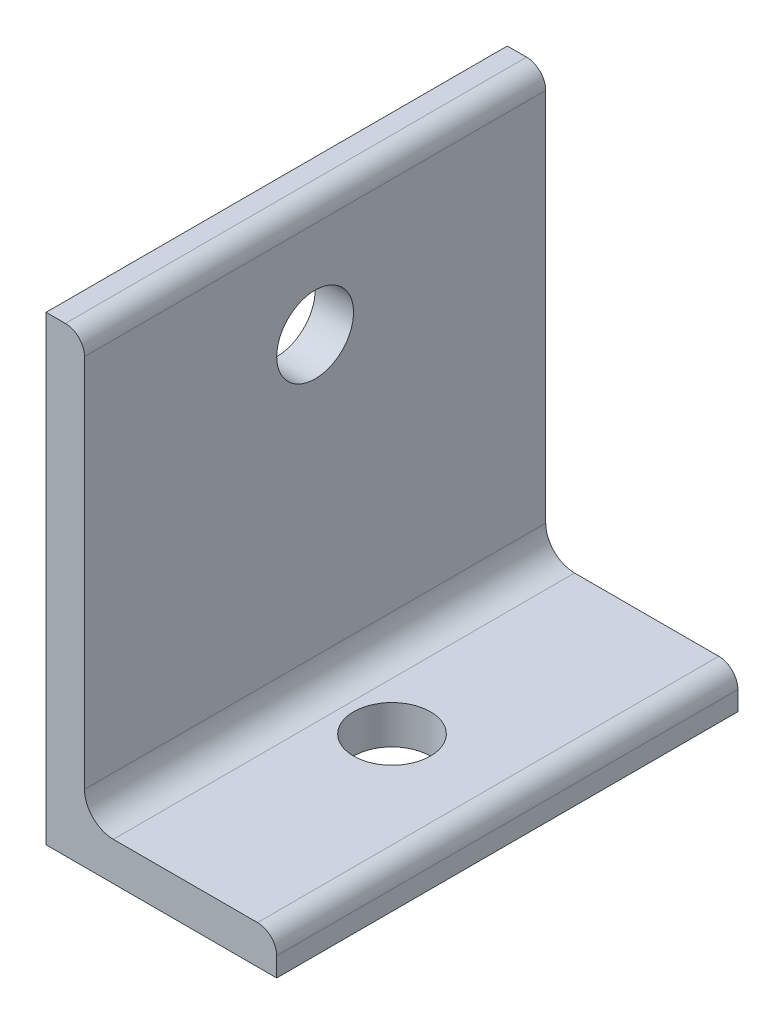
ISO-10303-21;
HEADER;
FILE_DESCRIPTION(('STEP AP214'),'2;1');
FILE_NAME('part.step','',(''),(''),'','','');
FILE_SCHEMA(('AUTOMOTIVE_DESIGN { 1 0 10303 214 1 1 1 1 }'));
ENDSEC;
DATA;
#1=APPLICATION_CONTEXT('core data for automotive mechanical design processes');
#2=APPLICATION_PROTOCOL_DEFINITION('international standard','automotive_design',2000,#1);
#3=PRODUCT_CONTEXT('',#1,'mechanical');
#4=PRODUCT('Part','Part','',(#3));
#5=PRODUCT_RELATED_PRODUCT_CATEGORY('part','',(#4));
#6=PRODUCT_DEFINITION_FORMATION('','',#4);
#7=PRODUCT_DEFINITION_CONTEXT('part definition',#1,'design');
#8=PRODUCT_DEFINITION('design','',#6,#7);
#9=PRODUCT_DEFINITION_SHAPE('','',#8);
#10=(LENGTH_UNIT() NAMED_UNIT(*) SI_UNIT(.MILLI.,.METRE.));
#11=(NAMED_UNIT(*) PLANE_ANGLE_UNIT() SI_UNIT($,.RADIAN.));
#12=(NAMED_UNIT(*) SI_UNIT($,.STERADIAN.) SOLID_ANGLE_UNIT());
#13=UNCERTAINTY_MEASURE_WITH_UNIT(LENGTH_MEASURE(1.E-05),#10,'distance_accuracy_value','');
#14=(GEOMETRIC_REPRESENTATION_CONTEXT(3) GLOBAL_UNCERTAINTY_ASSIGNED_CONTEXT((#13)) GLOBAL_UNIT_ASSIGNED_CONTEXT((#10,
#11,#12)) REPRESENTATION_CONTEXT('',''));
#15=CARTESIAN_POINT('',(0.,0.,0.));
#16=DIRECTION('',(0.,0.,1.));
#17=DIRECTION('',(1.,0.,0.));
#18=AXIS2_PLACEMENT_3D('',#15,#16,#17);
#19=CARTESIAN_POINT('',(38.1,0.,38.1));
#20=DIRECTION('',(0.,1.,0.));
#21=DIRECTION('',(-1.,0.,0.));
#22=AXIS2_PLACEMENT_3D('',#19,#20,#21);
#23=PLANE('',#22);
#24=CARTESIAN_POINT('',(19.05,0.,0.));
#25=DIRECTION('',(0.,-1.,0.));
#26=DIRECTION('',(1.,0.,0.));
#27=AXIS2_PLACEMENT_3D('',#24,#25,#26);
#28=CIRCLE('',#27,6.35);
#29=CARTESIAN_POINT('',(25.4,0.,0.));
#30=VERTEX_POINT('',#29);
#31=EDGE_CURVE('E196',#30,#30,#28,.T.);
#32=ORIENTED_EDGE('',*,*,#31,.F.);
#33=EDGE_LOOP('',(#32));
#34=FACE_BOUND('',#33,.T.);
#35=DIRECTION('',(1.,0.,0.));
#36=VECTOR('',#35,1.);
#37=CARTESIAN_POINT('',(38.1,0.,-38.1));
#38=LINE('',#37,#36);
#39=CARTESIAN_POINT('',(0.,0.,-38.1));
#40=VERTEX_POINT('',#39);
#41=CARTESIAN_POINT('',(38.1,0.,-38.1));
#42=VERTEX_POINT('',#41);
#43=EDGE_CURVE('E136',#40,#42,#38,.T.);
#44=ORIENTED_EDGE('',*,*,#43,.T.);
#45=DIRECTION('',(0.,0.,-1.));
#46=VECTOR('',#45,1.);
#47=CARTESIAN_POINT('',(38.1,0.,38.1));
#48=LINE('',#47,#46);
#49=CARTESIAN_POINT('',(38.1,0.,38.1));
#50=VERTEX_POINT('',#49);
#51=EDGE_CURVE('E11',#50,#42,#48,.T.);
#52=ORIENTED_EDGE('',*,*,#51,.F.);
#53=DIRECTION('',(1.,0.,0.));
#54=VECTOR('',#53,1.);
#55=CARTESIAN_POINT('',(38.1,0.,38.1));
#56=LINE('',#55,#54);
#57=CARTESIAN_POINT('',(0.,0.,38.1));
#58=VERTEX_POINT('',#57);
#59=EDGE_CURVE('E153',#58,#50,#56,.T.);
#60=ORIENTED_EDGE('',*,*,#59,.F.);
#61=DIRECTION('',(0.,0.,-1.));
#62=VECTOR('',#61,1.);
#63=CARTESIAN_POINT('',(0.,0.,38.1));
#64=LINE('',#63,#62);
#65=EDGE_CURVE('E132',#58,#40,#64,.T.);
#66=ORIENTED_EDGE('',*,*,#65,.T.);
#67=EDGE_LOOP('',(#44,#52,#60,#66));
#68=FACE_BOUND('',#67,.T.);
#69=ADVANCED_FACE('F34',(#34,#68),#23,.F.);
#70=CARTESIAN_POINT('',(38.1,3.18008,38.1));
#71=DIRECTION('',(-1.,0.,0.));
#72=DIRECTION('',(0.,0.,1.));
#73=AXIS2_PLACEMENT_3D('',#70,#71,#72);
#74=PLANE('',#73);
#75=DIRECTION('',(0.,1.,0.));
#76=VECTOR('',#75,1.);
#77=CARTESIAN_POINT('',(38.1,3.18008,-38.1));
#78=LINE('',#77,#76);
#79=CARTESIAN_POINT('',(38.1,3.18008,-38.1));
#80=VERTEX_POINT('',#79);
#81=EDGE_CURVE('E139',#42,#80,#78,.T.);
#82=ORIENTED_EDGE('',*,*,#81,.T.);
#83=DIRECTION('',(0.,0.,-1.));
#84=VECTOR('',#83,1.);
#85=CARTESIAN_POINT('',(38.1,3.18008,38.1));
#86=LINE('',#85,#84);
#87=CARTESIAN_POINT('',(38.1,3.18008,38.1));
#88=VERTEX_POINT('',#87);
#89=EDGE_CURVE('E42',#88,#80,#86,.T.);
#90=ORIENTED_EDGE('',*,*,#89,.F.);
#91=DIRECTION('',(0.,1.,0.));
#92=VECTOR('',#91,1.);
#93=CARTESIAN_POINT('',(38.1,3.18008,38.1));
#94=LINE('',#93,#92);
#95=EDGE_CURVE('E96',#50,#88,#94,.T.);
#96=ORIENTED_EDGE('',*,*,#95,.F.);
#97=ORIENTED_EDGE('',*,*,#51,.T.);
#98=EDGE_LOOP('',(#82,#90,#96,#97));
#99=FACE_BOUND('',#98,.T.);
#100=ADVANCED_FACE('F220',(#99),#74,.F.);
#101=CARTESIAN_POINT('',(34.93008,3.18008,38.1));
#102=DIRECTION('',(0.,0.,-1.));
#103=DIRECTION('',(-1.,0.,0.));
#104=AXIS2_PLACEMENT_3D('',#101,#102,#103);
#105=CYLINDRICAL_SURFACE('',#104,3.16992);
#106=CARTESIAN_POINT('',(34.93008,3.18008,-38.1));
#107=DIRECTION('',(0.,0.,1.));
#108=DIRECTION('',(1.,0.,0.));
#109=AXIS2_PLACEMENT_3D('',#106,#107,#108);
#110=CIRCLE('',#109,3.16992);
#111=CARTESIAN_POINT('',(34.93008,6.35,-38.1));
#112=VERTEX_POINT('',#111);
#113=EDGE_CURVE('E142',#80,#112,#110,.T.);
#114=ORIENTED_EDGE('',*,*,#113,.T.);
#115=DIRECTION('',(0.,0.,-1.));
#116=VECTOR('',#115,1.);
#117=CARTESIAN_POINT('',(34.93008,6.35,38.1));
#118=LINE('',#117,#116);
#119=CARTESIAN_POINT('',(34.93008,6.35,38.1));
#120=VERTEX_POINT('',#119);
#121=EDGE_CURVE('E163',#120,#112,#118,.T.);
#122=ORIENTED_EDGE('',*,*,#121,.F.);
#123=CARTESIAN_POINT('',(34.93008,3.18008,38.1));
#124=DIRECTION('',(0.,0.,1.));
#125=DIRECTION('',(1.,0.,0.));
#126=AXIS2_PLACEMENT_3D('',#123,#124,#125);
#127=CIRCLE('',#126,3.16992);
#128=EDGE_CURVE('E171',#88,#120,#127,.T.);
#129=ORIENTED_EDGE('',*,*,#128,.F.);
#130=ORIENTED_EDGE('',*,*,#89,.T.);
#131=EDGE_LOOP('',(#114,#122,#129,#130));
#132=FACE_BOUND('',#131,.T.);
#133=ADVANCED_FACE('F169',(#132),#105,.T.);
#134=CARTESIAN_POINT('',(11.1125,6.35,38.1));
#135=DIRECTION('',(0.,-1.,0.));
#136=DIRECTION('',(1.,0.,0.));
#137=AXIS2_PLACEMENT_3D('',#134,#135,#136);
#138=PLANE('',#137);
#139=CARTESIAN_POINT('',(19.05,6.35000000000001,0.));
#140=DIRECTION('',(0.,-1.,0.));
#141=DIRECTION('',(1.,0.,0.));
#142=AXIS2_PLACEMENT_3D('',#139,#140,#141);
#143=CIRCLE('',#142,6.35);
#144=CARTESIAN_POINT('',(25.4,6.35000000000001,0.));
#145=VERTEX_POINT('',#144);
#146=EDGE_CURVE('E140',#145,#145,#143,.F.);
#147=ORIENTED_EDGE('',*,*,#146,.F.);
#148=EDGE_LOOP('',(#147));
#149=FACE_BOUND('',#148,.T.);
#150=DIRECTION('',(-1.,0.,0.));
#151=VECTOR('',#150,1.);
#152=CARTESIAN_POINT('',(11.1125,6.35,-38.1));
#153=LINE('',#152,#151);
#154=CARTESIAN_POINT('',(11.1125,6.35,-38.1));
#155=VERTEX_POINT('',#154);
#156=EDGE_CURVE('E144',#112,#155,#153,.T.);
#157=ORIENTED_EDGE('',*,*,#156,.T.);
#158=DIRECTION('',(0.,0.,-1.));
#159=VECTOR('',#158,1.);
#160=CARTESIAN_POINT('',(11.1125,6.35,38.1));
#161=LINE('',#160,#159);
#162=CARTESIAN_POINT('',(11.1125,6.35,38.1));
#163=VERTEX_POINT('',#162);
#164=EDGE_CURVE('E160',#163,#155,#161,.T.);
#165=ORIENTED_EDGE('',*,*,#164,.F.);
#166=DIRECTION('',(-1.,0.,0.));
#167=VECTOR('',#166,1.);
#168=CARTESIAN_POINT('',(11.1125,6.35,38.1));
#169=LINE('',#168,#167);
#170=EDGE_CURVE('E187',#120,#163,#169,.T.);
#171=ORIENTED_EDGE('',*,*,#170,.F.);
#172=ORIENTED_EDGE('',*,*,#121,.T.);
#173=EDGE_LOOP('',(#157,#165,#171,#172));
#174=FACE_BOUND('',#173,.T.);
#175=ADVANCED_FACE('F180',(#149,#174),#138,.F.);
#176=CARTESIAN_POINT('',(11.1125,11.1125,38.1));
#177=DIRECTION('',(0.,0.,-1.));
#178=DIRECTION('',(-1.,0.,0.));
#179=AXIS2_PLACEMENT_3D('',#176,#177,#178);
#180=CYLINDRICAL_SURFACE('',#179,4.7625);
#181=CARTESIAN_POINT('',(11.1125,11.1125,-38.1));
#182=DIRECTION('',(0.,0.,-1.));
#183=DIRECTION('',(-1.,0.,0.));
#184=AXIS2_PLACEMENT_3D('',#181,#182,#183);
#185=CIRCLE('',#184,4.7625);
#186=CARTESIAN_POINT('',(6.35000000000001,11.1125,-38.1));
#187=VERTEX_POINT('',#186);
#188=EDGE_CURVE('E146',#155,#187,#185,.T.);
#189=ORIENTED_EDGE('',*,*,#188,.T.);
#190=DIRECTION('',(0.,0.,-1.));
#191=VECTOR('',#190,1.);
#192=CARTESIAN_POINT('',(6.35000000000001,11.1125,38.1));
#193=LINE('',#192,#191);
#194=CARTESIAN_POINT('',(6.35000000000001,11.1125,38.1));
#195=VERTEX_POINT('',#194);
#196=EDGE_CURVE('E157',#195,#187,#193,.T.);
#197=ORIENTED_EDGE('',*,*,#196,.F.);
#198=CARTESIAN_POINT('',(11.1125,11.1125,38.1));
#199=DIRECTION('',(0.,0.,-1.));
#200=DIRECTION('',(-1.,0.,0.));
#201=AXIS2_PLACEMENT_3D('',#198,#199,#200);
#202=CIRCLE('',#201,4.7625);
#203=EDGE_CURVE('E186',#163,#195,#202,.T.);
#204=ORIENTED_EDGE('',*,*,#203,.F.);
#205=ORIENTED_EDGE('',*,*,#164,.T.);
#206=EDGE_LOOP('',(#189,#197,#204,#205));
#207=FACE_BOUND('',#206,.T.);
#208=ADVANCED_FACE('F184',(#207),#180,.F.);
#209=CARTESIAN_POINT('',(6.35,73.03008,38.1));
#210=DIRECTION('',(-1.,0.,0.));
#211=DIRECTION('',(0.,-1.,0.));
#212=AXIS2_PLACEMENT_3D('',#209,#210,#211);
#213=PLANE('',#212);
#214=CARTESIAN_POINT('',(6.35000000000001,57.15,0.));
#215=DIRECTION('',(-1.,0.,0.));
#216=DIRECTION('',(0.,-1.,0.));
#217=AXIS2_PLACEMENT_3D('',#214,#215,#216);
#218=CIRCLE('',#217,6.35);
#219=CARTESIAN_POINT('',(6.35000000000001,50.8,0.));
#220=VERTEX_POINT('',#219);
#221=EDGE_CURVE('E199',#220,#220,#218,.T.);
#222=ORIENTED_EDGE('',*,*,#221,.T.);
#223=EDGE_LOOP('',(#222));
#224=FACE_BOUND('',#223,.T.);
#225=DIRECTION('',(0.,1.,0.));
#226=VECTOR('',#225,1.);
#227=CARTESIAN_POINT('',(6.35,73.03008,-38.1));
#228=LINE('',#227,#226);
#229=CARTESIAN_POINT('',(6.35,73.03008,-38.1));
#230=VERTEX_POINT('',#229);
#231=EDGE_CURVE('E148',#187,#230,#228,.T.);
#232=ORIENTED_EDGE('',*,*,#231,.T.);
#233=DIRECTION('',(0.,0.,-1.));
#234=VECTOR('',#233,1.);
#235=CARTESIAN_POINT('',(6.35,73.03008,38.1));
#236=LINE('',#235,#234);
#237=CARTESIAN_POINT('',(6.35,73.03008,38.1));
#238=VERTEX_POINT('',#237);
#239=EDGE_CURVE('E127',#238,#230,#236,.T.);
#240=ORIENTED_EDGE('',*,*,#239,.F.);
#241=DIRECTION('',(0.,1.,0.));
#242=VECTOR('',#241,1.);
#243=CARTESIAN_POINT('',(6.35,73.03008,38.1));
#244=LINE('',#243,#242);
#245=EDGE_CURVE('E118',#195,#238,#244,.T.);
#246=ORIENTED_EDGE('',*,*,#245,.F.);
#247=ORIENTED_EDGE('',*,*,#196,.T.);
#248=EDGE_LOOP('',(#232,#240,#246,#247));
#249=FACE_BOUND('',#248,.T.);
#250=ADVANCED_FACE('F230',(#224,#249),#213,.F.);
#251=CARTESIAN_POINT('',(3.18008,73.03008,38.1));
#252=DIRECTION('',(0.,0.,-1.));
#253=DIRECTION('',(-1.,0.,0.));
#254=AXIS2_PLACEMENT_3D('',#251,#252,#253);
#255=CYLINDRICAL_SURFACE('',#254,3.16992);
#256=CARTESIAN_POINT('',(3.18008,73.03008,-38.1));
#257=DIRECTION('',(0.,0.,1.));
#258=DIRECTION('',(-1.,0.,0.));
#259=AXIS2_PLACEMENT_3D('',#256,#257,#258);
#260=CIRCLE('',#259,3.16992);
#261=CARTESIAN_POINT('',(3.18008,76.2,-38.1));
#262=VERTEX_POINT('',#261);
#263=EDGE_CURVE('E126',#230,#262,#260,.T.);
#264=ORIENTED_EDGE('',*,*,#263,.T.);
#265=DIRECTION('',(0.,0.,-1.));
#266=VECTOR('',#265,1.);
#267=CARTESIAN_POINT('',(3.18008,76.2,38.1));
#268=LINE('',#267,#266);
#269=CARTESIAN_POINT('',(3.18008,76.2,38.1));
#270=VERTEX_POINT('',#269);
#271=EDGE_CURVE('E123',#270,#262,#268,.T.);
#272=ORIENTED_EDGE('',*,*,#271,.F.);
#273=CARTESIAN_POINT('',(3.18008,73.03008,38.1));
#274=DIRECTION('',(0.,0.,1.));
#275=DIRECTION('',(-1.,0.,0.));
#276=AXIS2_PLACEMENT_3D('',#273,#274,#275);
#277=CIRCLE('',#276,3.16992);
#278=EDGE_CURVE('E112',#238,#270,#277,.T.);
#279=ORIENTED_EDGE('',*,*,#278,.F.);
#280=ORIENTED_EDGE('',*,*,#239,.T.);
#281=EDGE_LOOP('',(#264,#272,#279,#280));
#282=FACE_BOUND('',#281,.T.);
#283=ADVANCED_FACE('F124',(#282),#255,.T.);
#284=CARTESIAN_POINT('',(0.,76.2,38.1));
#285=DIRECTION('',(0.,-1.,0.));
#286=DIRECTION('',(0.,0.,-1.));
#287=AXIS2_PLACEMENT_3D('',#284,#285,#286);
#288=PLANE('',#287);
#289=DIRECTION('',(-1.,0.,0.));
#290=VECTOR('',#289,1.);
#291=CARTESIAN_POINT('',(0.,76.2,-38.1));
#292=LINE('',#291,#290);
#293=CARTESIAN_POINT('',(0.,76.2,-38.1));
#294=VERTEX_POINT('',#293);
#295=EDGE_CURVE('E82',#262,#294,#292,.T.);
#296=ORIENTED_EDGE('',*,*,#295,.T.);
#297=DIRECTION('',(0.,0.,-1.));
#298=VECTOR('',#297,1.);
#299=CARTESIAN_POINT('',(0.,76.2,38.1));
#300=LINE('',#299,#298);
#301=CARTESIAN_POINT('',(0.,76.2,38.1));
#302=VERTEX_POINT('',#301);
#303=EDGE_CURVE('E128',#302,#294,#300,.T.);
#304=ORIENTED_EDGE('',*,*,#303,.F.);
#305=DIRECTION('',(-1.,0.,0.));
#306=VECTOR('',#305,1.);
#307=CARTESIAN_POINT('',(0.,76.2,38.1));
#308=LINE('',#307,#306);
#309=EDGE_CURVE('E116',#270,#302,#308,.T.);
#310=ORIENTED_EDGE('',*,*,#309,.F.);
#311=ORIENTED_EDGE('',*,*,#271,.T.);
#312=EDGE_LOOP('',(#296,#304,#310,#311));
#313=FACE_BOUND('',#312,.T.);
#314=ADVANCED_FACE('F130',(#313),#288,.F.);
#315=CARTESIAN_POINT('',(0.,0.,38.1));
#316=DIRECTION('',(1.,0.,0.));
#317=DIRECTION('',(0.,0.,-1.));
#318=AXIS2_PLACEMENT_3D('',#315,#316,#317);
#319=PLANE('',#318);
#320=CARTESIAN_POINT('',(0.,57.15,0.));
#321=DIRECTION('',(-1.,0.,0.));
#322=DIRECTION('',(0.,0.,1.));
#323=AXIS2_PLACEMENT_3D('',#320,#321,#322);
#324=CIRCLE('',#323,6.35);
#325=CARTESIAN_POINT('',(0.,57.15,6.35));
#326=VERTEX_POINT('',#325);
#327=EDGE_CURVE('E202',#326,#326,#324,.T.);
#328=ORIENTED_EDGE('',*,*,#327,.F.);
#329=EDGE_LOOP('',(#328));
#330=FACE_BOUND('',#329,.T.);
#331=DIRECTION('',(0.,-1.,0.));
#332=VECTOR('',#331,1.);
#333=CARTESIAN_POINT('',(0.,0.,-38.1));
#334=LINE('',#333,#332);
#335=EDGE_CURVE('E88',#294,#40,#334,.T.);
#336=ORIENTED_EDGE('',*,*,#335,.T.);
#337=ORIENTED_EDGE('',*,*,#65,.F.);
#338=DIRECTION('',(0.,-1.,0.));
#339=VECTOR('',#338,1.);
#340=CARTESIAN_POINT('',(0.,0.,38.1));
#341=LINE('',#340,#339);
#342=EDGE_CURVE('E50',#302,#58,#341,.T.);
#343=ORIENTED_EDGE('',*,*,#342,.F.);
#344=ORIENTED_EDGE('',*,*,#303,.T.);
#345=EDGE_LOOP('',(#336,#337,#343,#344));
#346=FACE_BOUND('',#345,.T.);
#347=ADVANCED_FACE('F209',(#330,#346),#319,.F.);
#348=CARTESIAN_POINT('',(3.18008,73.03008,38.1));
#349=DIRECTION('',(0.,0.,-1.));
#350=DIRECTION('',(-1.,0.,0.));
#351=AXIS2_PLACEMENT_3D('',#348,#349,#350);
#352=PLANE('',#351);
#353=ORIENTED_EDGE('',*,*,#59,.T.);
#354=ORIENTED_EDGE('',*,*,#95,.T.);
#355=ORIENTED_EDGE('',*,*,#128,.T.);
#356=ORIENTED_EDGE('',*,*,#170,.T.);
#357=ORIENTED_EDGE('',*,*,#203,.T.);
#358=ORIENTED_EDGE('',*,*,#245,.T.);
#359=ORIENTED_EDGE('',*,*,#278,.T.);
#360=ORIENTED_EDGE('',*,*,#309,.T.);
#361=ORIENTED_EDGE('',*,*,#342,.T.);
#362=EDGE_LOOP('',(#353,#354,#355,#356,#357,#358,#359,#360,#361));
#363=FACE_BOUND('',#362,.T.);
#364=ADVANCED_FACE('F114',(#363),#352,.F.);
#365=CARTESIAN_POINT('',(3.18008,73.03008,-38.1));
#366=DIRECTION('',(0.,0.,-1.));
#367=DIRECTION('',(-1.,0.,0.));
#368=AXIS2_PLACEMENT_3D('',#365,#366,#367);
#369=PLANE('',#368);
#370=ORIENTED_EDGE('',*,*,#43,.F.);
#371=ORIENTED_EDGE('',*,*,#335,.F.);
#372=ORIENTED_EDGE('',*,*,#295,.F.);
#373=ORIENTED_EDGE('',*,*,#263,.F.);
#374=ORIENTED_EDGE('',*,*,#231,.F.);
#375=ORIENTED_EDGE('',*,*,#188,.F.);
#376=ORIENTED_EDGE('',*,*,#156,.F.);
#377=ORIENTED_EDGE('',*,*,#113,.F.);
#378=ORIENTED_EDGE('',*,*,#81,.F.);
#379=EDGE_LOOP('',(#370,#371,#372,#373,#374,#375,#376,#377,#378));
#380=FACE_BOUND('',#379,.T.);
#381=ADVANCED_FACE('F175',(#380),#369,.T.);
#382=CARTESIAN_POINT('',(19.05,76.201,0.));
#383=DIRECTION('',(0.,-1.,0.));
#384=DIRECTION('',(1.,0.,0.));
#385=AXIS2_PLACEMENT_3D('',#382,#383,#384);
#386=CYLINDRICAL_SURFACE('',#385,6.35);
#387=ORIENTED_EDGE('',*,*,#31,.T.);
#388=EDGE_LOOP('',(#387));
#389=FACE_BOUND('',#388,.T.);
#390=ORIENTED_EDGE('',*,*,#146,.T.);
#391=EDGE_LOOP('',(#390));
#392=FACE_BOUND('',#391,.T.);
#393=ADVANCED_FACE('F286',(#389,#392),#386,.F.);
#394=CARTESIAN_POINT('',(38.1,57.15,0.));
#395=DIRECTION('',(-1.,0.,0.));
#396=DIRECTION('',(0.,0.,1.));
#397=AXIS2_PLACEMENT_3D('',#394,#395,#396);
#398=CYLINDRICAL_SURFACE('',#397,6.35);
#399=ORIENTED_EDGE('',*,*,#327,.T.);
#400=EDGE_LOOP('',(#399));
#401=FACE_BOUND('',#400,.T.);
#402=ORIENTED_EDGE('',*,*,#221,.F.);
#403=EDGE_LOOP('',(#402));
#404=FACE_BOUND('',#403,.T.);
#405=ADVANCED_FACE('F206',(#401,#404),#398,.F.);
#406=CLOSED_SHELL('',(#69,#100,#133,#175,#208,#250,#283,#314,#347,#364,#381,#393,#405));
#407=MANIFOLD_SOLID_BREP('B2',#406);
#408=ADVANCED_BREP_SHAPE_REPRESENTATION('',(#18,#407),#14);
#409=SHAPE_DEFINITION_REPRESENTATION(#9,#408);
ENDSEC;
END-ISO-10303-21;
